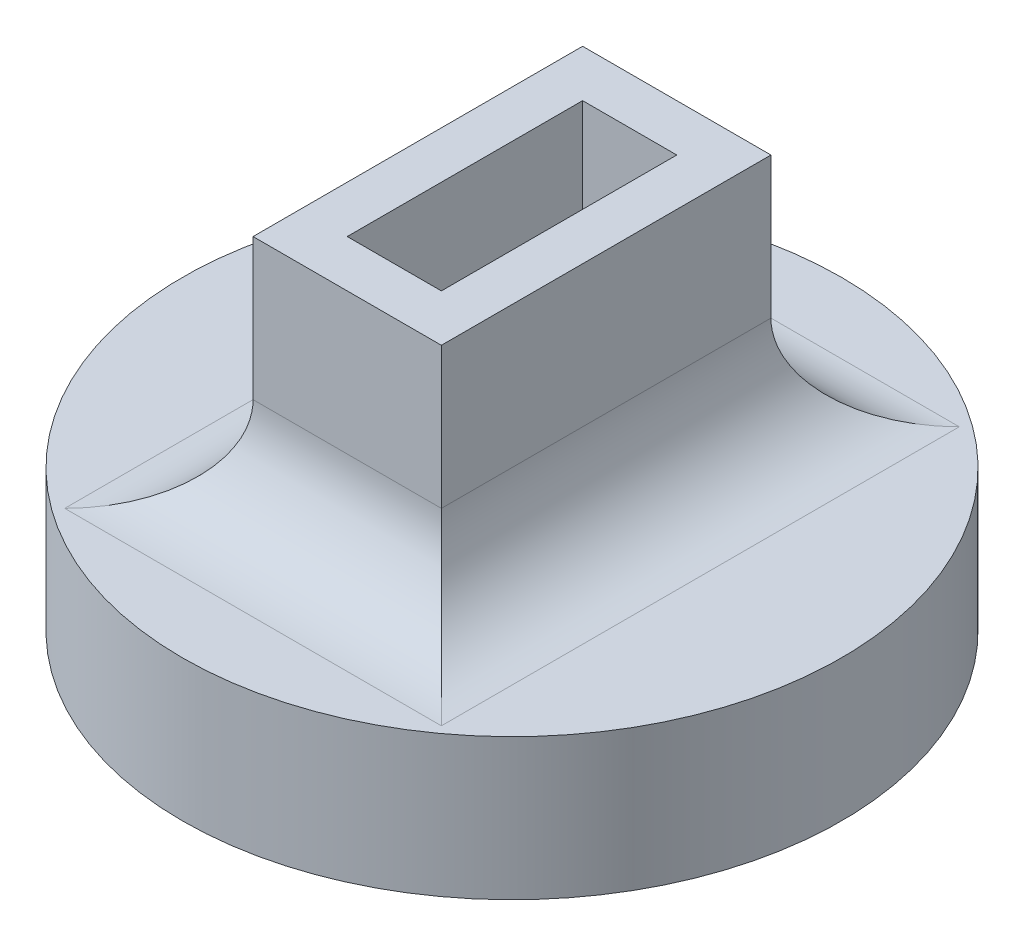
ISO-10303-21;
HEADER;
FILE_DESCRIPTION(('STEP AP214'),'2;1');
FILE_NAME('part.step','',(''),(''),'','','');
FILE_SCHEMA(('AUTOMOTIVE_DESIGN { 1 0 10303 214 1 1 1 1 }'));
ENDSEC;
DATA;
#1=APPLICATION_CONTEXT('core data for automotive mechanical design processes');
#2=APPLICATION_PROTOCOL_DEFINITION('international standard','automotive_design',2000,#1);
#3=PRODUCT_CONTEXT('',#1,'mechanical');
#4=PRODUCT('Part','Part','',(#3));
#5=PRODUCT_RELATED_PRODUCT_CATEGORY('part','',(#4));
#6=PRODUCT_DEFINITION_FORMATION('','',#4);
#7=PRODUCT_DEFINITION_CONTEXT('part definition',#1,'design');
#8=PRODUCT_DEFINITION('design','',#6,#7);
#9=PRODUCT_DEFINITION_SHAPE('','',#8);
#10=(LENGTH_UNIT() NAMED_UNIT(*) SI_UNIT(.MILLI.,.METRE.));
#11=(NAMED_UNIT(*) PLANE_ANGLE_UNIT() SI_UNIT($,.RADIAN.));
#12=(NAMED_UNIT(*) SI_UNIT($,.STERADIAN.) SOLID_ANGLE_UNIT());
#13=UNCERTAINTY_MEASURE_WITH_UNIT(LENGTH_MEASURE(1.E-05),#10,'distance_accuracy_value','');
#14=(GEOMETRIC_REPRESENTATION_CONTEXT(3) GLOBAL_UNCERTAINTY_ASSIGNED_CONTEXT((#13)) GLOBAL_UNIT_ASSIGNED_CONTEXT((#10,
#11,#12)) REPRESENTATION_CONTEXT('',''));
#15=CARTESIAN_POINT('',(0.,0.,0.));
#16=DIRECTION('',(0.,0.,1.));
#17=DIRECTION('',(1.,0.,0.));
#18=AXIS2_PLACEMENT_3D('',#15,#16,#17);
#19=CARTESIAN_POINT('',(0.,3.,0.));
#20=DIRECTION('',(0.,1.,0.));
#21=DIRECTION('',(0.,0.,1.));
#22=AXIS2_PLACEMENT_3D('',#19,#20,#21);
#23=PLANE('',#22);
#24=DIRECTION('',(0.,0.,1.));
#25=VECTOR('',#24,1.);
#26=CARTESIAN_POINT('',(-4.,3.,0.));
#27=LINE('',#26,#25);
#28=CARTESIAN_POINT('',(-4.,3.,5.5));
#29=VERTEX_POINT('',#28);
#30=CARTESIAN_POINT('',(-4.,3.,-5.5));
#31=VERTEX_POINT('',#30);
#32=EDGE_CURVE('E230',#29,#31,#27,.F.);
#33=ORIENTED_EDGE('',*,*,#32,.T.);
#34=DIRECTION('',(1.,0.,0.));
#35=VECTOR('',#34,1.);
#36=CARTESIAN_POINT('',(2.,3.,-5.5));
#37=LINE('',#36,#35);
#38=CARTESIAN_POINT('',(4.,3.,-5.5));
#39=VERTEX_POINT('',#38);
#40=EDGE_CURVE('E242',#31,#39,#37,.T.);
#41=ORIENTED_EDGE('',*,*,#40,.T.);
#42=DIRECTION('',(0.,0.,1.));
#43=VECTOR('',#42,1.);
#44=CARTESIAN_POINT('',(4.,3.,3.5));
#45=LINE('',#44,#43);
#46=CARTESIAN_POINT('',(4.,3.,5.5));
#47=VERTEX_POINT('',#46);
#48=EDGE_CURVE('E239',#39,#47,#45,.T.);
#49=ORIENTED_EDGE('',*,*,#48,.T.);
#50=DIRECTION('',(1.,0.,0.));
#51=VECTOR('',#50,1.);
#52=CARTESIAN_POINT('',(0.,3.,5.5));
#53=LINE('',#52,#51);
#54=EDGE_CURVE('E236',#47,#29,#53,.F.);
#55=ORIENTED_EDGE('',*,*,#54,.T.);
#56=EDGE_LOOP('',(#33,#41,#49,#55));
#57=FACE_BOUND('',#56,.T.);
#58=CARTESIAN_POINT('',(0.,3.,0.));
#59=DIRECTION('',(0.,1.,0.));
#60=DIRECTION('',(0.,0.,1.));
#61=AXIS2_PLACEMENT_3D('',#58,#59,#60);
#62=CIRCLE('',#61,7.);
#63=CARTESIAN_POINT('',(0.,3.,7.));
#64=VERTEX_POINT('',#63);
#65=EDGE_CURVE('E226',#64,#64,#62,.T.);
#66=ORIENTED_EDGE('',*,*,#65,.T.);
#67=EDGE_LOOP('',(#66));
#68=FACE_BOUND('',#67,.T.);
#69=ADVANCED_FACE('F63',(#57,#68),#23,.T.);
#70=CARTESIAN_POINT('',(0.,3.,0.));
#71=DIRECTION('',(0.,-1.,0.));
#72=DIRECTION('',(0.,0.,-1.));
#73=AXIS2_PLACEMENT_3D('',#70,#71,#72);
#74=CYLINDRICAL_SURFACE('',#73,7.);
#75=ORIENTED_EDGE('',*,*,#65,.F.);
#76=EDGE_LOOP('',(#75));
#77=FACE_BOUND('',#76,.T.);
#78=CARTESIAN_POINT('',(0.,0.,0.));
#79=DIRECTION('',(0.,1.,0.));
#80=DIRECTION('',(0.,0.,1.));
#81=AXIS2_PLACEMENT_3D('',#78,#79,#80);
#82=CIRCLE('',#81,7.);
#83=CARTESIAN_POINT('',(0.,0.,7.));
#84=VERTEX_POINT('',#83);
#85=EDGE_CURVE('E225',#84,#84,#82,.T.);
#86=ORIENTED_EDGE('',*,*,#85,.T.);
#87=EDGE_LOOP('',(#86));
#88=FACE_BOUND('',#87,.T.);
#89=ADVANCED_FACE('F291',(#77,#88),#74,.T.);
#90=CARTESIAN_POINT('',(0.,0.,0.));
#91=DIRECTION('',(0.,1.,0.));
#92=DIRECTION('',(0.,0.,1.));
#93=AXIS2_PLACEMENT_3D('',#90,#91,#92);
#94=PLANE('',#93);
#95=ORIENTED_EDGE('',*,*,#85,.F.);
#96=EDGE_LOOP('',(#95));
#97=FACE_BOUND('',#96,.T.);
#98=ADVANCED_FACE('F298',(#97),#94,.F.);
#99=CARTESIAN_POINT('',(-2.,8.,3.5));
#100=DIRECTION('',(0.,0.,-1.));
#101=DIRECTION('',(-1.,0.,0.));
#102=AXIS2_PLACEMENT_3D('',#99,#100,#101);
#103=PLANE('',#102);
#104=DIRECTION('',(0.,-1.,0.));
#105=VECTOR('',#104,1.);
#106=CARTESIAN_POINT('',(-2.,8.,3.5));
#107=LINE('',#106,#105);
#108=CARTESIAN_POINT('',(-2.,8.,3.5));
#109=VERTEX_POINT('',#108);
#110=CARTESIAN_POINT('',(-2.,5.,3.5));
#111=VERTEX_POINT('',#110);
#112=EDGE_CURVE('E212',#109,#111,#107,.T.);
#113=ORIENTED_EDGE('',*,*,#112,.T.);
#114=DIRECTION('',(1.,0.,0.));
#115=VECTOR('',#114,1.);
#116=CARTESIAN_POINT('',(-2.,5.,3.5));
#117=LINE('',#116,#115);
#118=CARTESIAN_POINT('',(2.,5.,3.5));
#119=VERTEX_POINT('',#118);
#120=EDGE_CURVE('E73',#111,#119,#117,.T.);
#121=ORIENTED_EDGE('',*,*,#120,.T.);
#122=DIRECTION('',(0.,-1.,0.));
#123=VECTOR('',#122,1.);
#124=CARTESIAN_POINT('',(2.,8.,3.5));
#125=LINE('',#124,#123);
#126=CARTESIAN_POINT('',(2.,8.,3.5));
#127=VERTEX_POINT('',#126);
#128=EDGE_CURVE('E222',#127,#119,#125,.T.);
#129=ORIENTED_EDGE('',*,*,#128,.F.);
#130=DIRECTION('',(1.,0.,0.));
#131=VECTOR('',#130,1.);
#132=CARTESIAN_POINT('',(-2.,8.,3.5));
#133=LINE('',#132,#131);
#134=EDGE_CURVE('E155',#109,#127,#133,.T.);
#135=ORIENTED_EDGE('',*,*,#134,.F.);
#136=EDGE_LOOP('',(#113,#121,#129,#135));
#137=FACE_BOUND('',#136,.T.);
#138=ADVANCED_FACE('F303',(#137),#103,.F.);
#139=CARTESIAN_POINT('',(2.,8.,-3.5));
#140=DIRECTION('',(1.,0.,0.));
#141=DIRECTION('',(0.,0.,-1.));
#142=AXIS2_PLACEMENT_3D('',#139,#140,#141);
#143=PLANE('',#142);
#144=ORIENTED_EDGE('',*,*,#128,.T.);
#145=DIRECTION('',(0.,0.,1.));
#146=VECTOR('',#145,1.);
#147=CARTESIAN_POINT('',(2.,5.,-3.5));
#148=LINE('',#147,#146);
#149=CARTESIAN_POINT('',(2.,5.,-3.5));
#150=VERTEX_POINT('',#149);
#151=EDGE_CURVE('E250',#119,#150,#148,.F.);
#152=ORIENTED_EDGE('',*,*,#151,.T.);
#153=DIRECTION('',(0.,-1.,0.));
#154=VECTOR('',#153,1.);
#155=CARTESIAN_POINT('',(2.,8.,-3.5));
#156=LINE('',#155,#154);
#157=CARTESIAN_POINT('',(2.,8.,-3.5));
#158=VERTEX_POINT('',#157);
#159=EDGE_CURVE('E218',#158,#150,#156,.T.);
#160=ORIENTED_EDGE('',*,*,#159,.F.);
#161=DIRECTION('',(0.,0.,1.));
#162=VECTOR('',#161,1.);
#163=CARTESIAN_POINT('',(2.,8.,-3.5));
#164=LINE('',#163,#162);
#165=EDGE_CURVE('E201',#158,#127,#164,.T.);
#166=ORIENTED_EDGE('',*,*,#165,.T.);
#167=EDGE_LOOP('',(#144,#152,#160,#166));
#168=FACE_BOUND('',#167,.T.);
#169=ADVANCED_FACE('F279',(#168),#143,.T.);
#170=CARTESIAN_POINT('',(-2.,8.,-3.5));
#171=DIRECTION('',(0.,0.,-1.));
#172=DIRECTION('',(-1.,0.,0.));
#173=AXIS2_PLACEMENT_3D('',#170,#171,#172);
#174=PLANE('',#173);
#175=ORIENTED_EDGE('',*,*,#159,.T.);
#176=DIRECTION('',(1.,0.,0.));
#177=VECTOR('',#176,1.);
#178=CARTESIAN_POINT('',(-2.,5.,-3.5));
#179=LINE('',#178,#177);
#180=CARTESIAN_POINT('',(-2.,5.,-3.5));
#181=VERTEX_POINT('',#180);
#182=EDGE_CURVE('E246',#150,#181,#179,.F.);
#183=ORIENTED_EDGE('',*,*,#182,.T.);
#184=DIRECTION('',(0.,-1.,0.));
#185=VECTOR('',#184,1.);
#186=CARTESIAN_POINT('',(-2.,8.,-3.5));
#187=LINE('',#186,#185);
#188=CARTESIAN_POINT('',(-2.,8.,-3.5));
#189=VERTEX_POINT('',#188);
#190=EDGE_CURVE('E215',#189,#181,#187,.T.);
#191=ORIENTED_EDGE('',*,*,#190,.F.);
#192=DIRECTION('',(1.,0.,0.));
#193=VECTOR('',#192,1.);
#194=CARTESIAN_POINT('',(-2.,8.,-3.5));
#195=LINE('',#194,#193);
#196=EDGE_CURVE('E205',#189,#158,#195,.T.);
#197=ORIENTED_EDGE('',*,*,#196,.T.);
#198=EDGE_LOOP('',(#175,#183,#191,#197));
#199=FACE_BOUND('',#198,.T.);
#200=ADVANCED_FACE('F283',(#199),#174,.T.);
#201=CARTESIAN_POINT('',(-2.,8.,-3.5));
#202=DIRECTION('',(1.,0.,0.));
#203=DIRECTION('',(0.,0.,-1.));
#204=AXIS2_PLACEMENT_3D('',#201,#202,#203);
#205=PLANE('',#204);
#206=ORIENTED_EDGE('',*,*,#190,.T.);
#207=DIRECTION('',(0.,0.,1.));
#208=VECTOR('',#207,1.);
#209=CARTESIAN_POINT('',(-2.,5.,-3.5));
#210=LINE('',#209,#208);
#211=EDGE_CURVE('E12',#181,#111,#210,.T.);
#212=ORIENTED_EDGE('',*,*,#211,.T.);
#213=ORIENTED_EDGE('',*,*,#112,.F.);
#214=DIRECTION('',(0.,0.,1.));
#215=VECTOR('',#214,1.);
#216=CARTESIAN_POINT('',(-2.,8.,-3.5));
#217=LINE('',#216,#215);
#218=EDGE_CURVE('E209',#189,#109,#217,.T.);
#219=ORIENTED_EDGE('',*,*,#218,.F.);
#220=EDGE_LOOP('',(#206,#212,#213,#219));
#221=FACE_BOUND('',#220,.T.);
#222=ADVANCED_FACE('F342',(#221),#205,.F.);
#223=CARTESIAN_POINT('',(0.,8.,0.));
#224=DIRECTION('',(0.,-1.,0.));
#225=DIRECTION('',(0.,0.,-1.));
#226=AXIS2_PLACEMENT_3D('',#223,#224,#225);
#227=PLANE('',#226);
#228=DIRECTION('',(1.,0.,0.));
#229=VECTOR('',#228,1.);
#230=CARTESIAN_POINT('',(0.,8.,-2.5));
#231=LINE('',#230,#229);
#232=CARTESIAN_POINT('',(-1.,8.,-2.5));
#233=VERTEX_POINT('',#232);
#234=CARTESIAN_POINT('',(1.,8.,-2.5));
#235=VERTEX_POINT('',#234);
#236=EDGE_CURVE('E149',#233,#235,#231,.T.);
#237=ORIENTED_EDGE('',*,*,#236,.T.);
#238=DIRECTION('',(0.,0.,1.));
#239=VECTOR('',#238,1.);
#240=CARTESIAN_POINT('',(1.,8.,0.));
#241=LINE('',#240,#239);
#242=CARTESIAN_POINT('',(1.,8.,2.5));
#243=VERTEX_POINT('',#242);
#244=EDGE_CURVE('E160',#235,#243,#241,.T.);
#245=ORIENTED_EDGE('',*,*,#244,.T.);
#246=DIRECTION('',(1.,0.,0.));
#247=VECTOR('',#246,1.);
#248=CARTESIAN_POINT('',(0.,8.,2.5));
#249=LINE('',#248,#247);
#250=CARTESIAN_POINT('',(-0.999999999999999,8.,2.5));
#251=VERTEX_POINT('',#250);
#252=EDGE_CURVE('E176',#251,#243,#249,.T.);
#253=ORIENTED_EDGE('',*,*,#252,.F.);
#254=DIRECTION('',(0.,0.,1.));
#255=VECTOR('',#254,1.);
#256=CARTESIAN_POINT('',(-1.,8.,0.));
#257=LINE('',#256,#255);
#258=EDGE_CURVE('E172',#233,#251,#257,.T.);
#259=ORIENTED_EDGE('',*,*,#258,.F.);
#260=EDGE_LOOP('',(#237,#245,#253,#259));
#261=FACE_BOUND('',#260,.T.);
#262=ORIENTED_EDGE('',*,*,#134,.T.);
#263=ORIENTED_EDGE('',*,*,#165,.F.);
#264=ORIENTED_EDGE('',*,*,#196,.F.);
#265=ORIENTED_EDGE('',*,*,#218,.T.);
#266=EDGE_LOOP('',(#262,#263,#264,#265));
#267=FACE_BOUND('',#266,.T.);
#268=ADVANCED_FACE('F169',(#261,#267),#227,.F.);
#269=CARTESIAN_POINT('',(1.,8.,0.));
#270=DIRECTION('',(1.,0.,0.));
#271=DIRECTION('',(0.,0.,-1.));
#272=AXIS2_PLACEMENT_3D('',#269,#270,#271);
#273=PLANE('',#272);
#274=DIRECTION('',(0.,0.,1.));
#275=VECTOR('',#274,1.);
#276=CARTESIAN_POINT('',(1.,3.,0.));
#277=LINE('',#276,#275);
#278=CARTESIAN_POINT('',(1.,3.,-2.5));
#279=VERTEX_POINT('',#278);
#280=CARTESIAN_POINT('',(1.,3.,2.5));
#281=VERTEX_POINT('',#280);
#282=EDGE_CURVE('E181',#279,#281,#277,.T.);
#283=ORIENTED_EDGE('',*,*,#282,.T.);
#284=DIRECTION('',(0.,-1.,0.));
#285=VECTOR('',#284,1.);
#286=CARTESIAN_POINT('',(1.,8.,2.5));
#287=LINE('',#286,#285);
#288=EDGE_CURVE('E163',#243,#281,#287,.T.);
#289=ORIENTED_EDGE('',*,*,#288,.F.);
#290=ORIENTED_EDGE('',*,*,#244,.F.);
#291=DIRECTION('',(0.,-1.,0.));
#292=VECTOR('',#291,1.);
#293=CARTESIAN_POINT('',(1.,8.,-2.5));
#294=LINE('',#293,#292);
#295=EDGE_CURVE('E144',#235,#279,#294,.T.);
#296=ORIENTED_EDGE('',*,*,#295,.T.);
#297=EDGE_LOOP('',(#283,#289,#290,#296));
#298=FACE_BOUND('',#297,.T.);
#299=ADVANCED_FACE('F161',(#298),#273,.F.);
#300=CARTESIAN_POINT('',(0.,8.,-2.5));
#301=DIRECTION('',(0.,0.,-1.));
#302=DIRECTION('',(-1.,0.,0.));
#303=AXIS2_PLACEMENT_3D('',#300,#301,#302);
#304=PLANE('',#303);
#305=DIRECTION('',(1.,0.,0.));
#306=VECTOR('',#305,1.);
#307=CARTESIAN_POINT('',(0.,3.,-2.5));
#308=LINE('',#307,#306);
#309=CARTESIAN_POINT('',(-1.,3.,-2.5));
#310=VERTEX_POINT('',#309);
#311=EDGE_CURVE('E151',#310,#279,#308,.T.);
#312=ORIENTED_EDGE('',*,*,#311,.T.);
#313=ORIENTED_EDGE('',*,*,#295,.F.);
#314=ORIENTED_EDGE('',*,*,#236,.F.);
#315=DIRECTION('',(0.,-1.,0.));
#316=VECTOR('',#315,1.);
#317=CARTESIAN_POINT('',(-1.,8.,-2.5));
#318=LINE('',#317,#316);
#319=EDGE_CURVE('E156',#233,#310,#318,.T.);
#320=ORIENTED_EDGE('',*,*,#319,.T.);
#321=EDGE_LOOP('',(#312,#313,#314,#320));
#322=FACE_BOUND('',#321,.T.);
#323=ADVANCED_FACE('F146',(#322),#304,.F.);
#324=CARTESIAN_POINT('',(-1.,8.,0.));
#325=DIRECTION('',(1.,0.,0.));
#326=DIRECTION('',(0.,0.,-1.));
#327=AXIS2_PLACEMENT_3D('',#324,#325,#326);
#328=PLANE('',#327);
#329=DIRECTION('',(0.,0.,1.));
#330=VECTOR('',#329,1.);
#331=CARTESIAN_POINT('',(-1.,3.,0.));
#332=LINE('',#331,#330);
#333=CARTESIAN_POINT('',(-0.999999999999999,3.,2.5));
#334=VERTEX_POINT('',#333);
#335=EDGE_CURVE('E186',#310,#334,#332,.T.);
#336=ORIENTED_EDGE('',*,*,#335,.F.);
#337=ORIENTED_EDGE('',*,*,#319,.F.);
#338=ORIENTED_EDGE('',*,*,#258,.T.);
#339=DIRECTION('',(0.,-1.,0.));
#340=VECTOR('',#339,1.);
#341=CARTESIAN_POINT('',(-0.999999999999999,8.,2.5));
#342=LINE('',#341,#340);
#343=EDGE_CURVE('E193',#251,#334,#342,.T.);
#344=ORIENTED_EDGE('',*,*,#343,.T.);
#345=EDGE_LOOP('',(#336,#337,#338,#344));
#346=FACE_BOUND('',#345,.T.);
#347=ADVANCED_FACE('F325',(#346),#328,.T.);
#348=CARTESIAN_POINT('',(0.,8.,2.5));
#349=DIRECTION('',(0.,0.,-1.));
#350=DIRECTION('',(-1.,0.,0.));
#351=AXIS2_PLACEMENT_3D('',#348,#349,#350);
#352=PLANE('',#351);
#353=DIRECTION('',(1.,0.,0.));
#354=VECTOR('',#353,1.);
#355=CARTESIAN_POINT('',(0.,3.,2.5));
#356=LINE('',#355,#354);
#357=EDGE_CURVE('E167',#334,#281,#356,.T.);
#358=ORIENTED_EDGE('',*,*,#357,.F.);
#359=ORIENTED_EDGE('',*,*,#343,.F.);
#360=ORIENTED_EDGE('',*,*,#252,.T.);
#361=ORIENTED_EDGE('',*,*,#288,.T.);
#362=EDGE_LOOP('',(#358,#359,#360,#361));
#363=FACE_BOUND('',#362,.T.);
#364=ADVANCED_FACE('F320',(#363),#352,.T.);
#365=ORIENTED_EDGE('',*,*,#357,.T.);
#366=ORIENTED_EDGE('',*,*,#282,.F.);
#367=ORIENTED_EDGE('',*,*,#311,.F.);
#368=ORIENTED_EDGE('',*,*,#335,.T.);
#369=EDGE_LOOP('',(#365,#366,#367,#368));
#370=FACE_BOUND('',#369,.T.);
#371=ADVANCED_FACE('F293',(#370),#23,.T.);
#372=CARTESIAN_POINT('',(-2.,5.,5.5));
#373=DIRECTION('',(1.,0.,0.));
#374=DIRECTION('',(0.,0.,-1.));
#375=AXIS2_PLACEMENT_3D('',#372,#373,#374);
#376=CYLINDRICAL_SURFACE('',#375,2.);
#377=CARTESIAN_POINT('',(4.,5.,5.5));
#378=DIRECTION('',(0.707106781186547,0.,-0.707106781186548));
#379=DIRECTION('',(0.707106781186548,0.,0.707106781186547));
#380=AXIS2_PLACEMENT_3D('',#377,#378,#379);
#381=ELLIPSE('',#380,2.82842712474619,2.);
#382=EDGE_CURVE('E260',#119,#47,#381,.F.);
#383=ORIENTED_EDGE('',*,*,#382,.F.);
#384=ORIENTED_EDGE('',*,*,#120,.F.);
#385=CARTESIAN_POINT('',(-4.,5.,5.5));
#386=DIRECTION('',(0.707106781186548,0.,0.707106781186547));
#387=DIRECTION('',(-0.707106781186547,0.,0.707106781186548));
#388=AXIS2_PLACEMENT_3D('',#385,#386,#387);
#389=ELLIPSE('',#388,2.82842712474619,2.);
#390=EDGE_CURVE('E67',#29,#111,#389,.T.);
#391=ORIENTED_EDGE('',*,*,#390,.F.);
#392=ORIENTED_EDGE('',*,*,#54,.F.);
#393=EDGE_LOOP('',(#383,#384,#391,#392));
#394=FACE_BOUND('',#393,.T.);
#395=ADVANCED_FACE('F65',(#394),#376,.F.);
#396=CARTESIAN_POINT('',(-4.,5.,-3.5));
#397=DIRECTION('',(0.,0.,1.));
#398=DIRECTION('',(1.,0.,0.));
#399=AXIS2_PLACEMENT_3D('',#396,#397,#398);
#400=CYLINDRICAL_SURFACE('',#399,2.);
#401=ORIENTED_EDGE('',*,*,#390,.T.);
#402=ORIENTED_EDGE('',*,*,#211,.F.);
#403=CARTESIAN_POINT('',(-4.,5.,-5.5));
#404=DIRECTION('',(-0.707106781186547,0.,0.707106781186548));
#405=DIRECTION('',(0.707106781186548,0.,0.707106781186547));
#406=AXIS2_PLACEMENT_3D('',#403,#404,#405);
#407=ELLIPSE('',#406,2.82842712474619,2.);
#408=EDGE_CURVE('E258',#31,#181,#407,.T.);
#409=ORIENTED_EDGE('',*,*,#408,.F.);
#410=ORIENTED_EDGE('',*,*,#32,.F.);
#411=EDGE_LOOP('',(#401,#402,#409,#410));
#412=FACE_BOUND('',#411,.T.);
#413=ADVANCED_FACE('F272',(#412),#400,.F.);
#414=CARTESIAN_POINT('',(4.,5.,0.));
#415=DIRECTION('',(0.,0.,-1.));
#416=DIRECTION('',(-1.,0.,0.));
#417=AXIS2_PLACEMENT_3D('',#414,#415,#416);
#418=CYLINDRICAL_SURFACE('',#417,2.);
#419=ORIENTED_EDGE('',*,*,#382,.T.);
#420=ORIENTED_EDGE('',*,*,#48,.F.);
#421=CARTESIAN_POINT('',(4.,5.,-5.5));
#422=DIRECTION('',(-0.707106781186548,0.,-0.707106781186547));
#423=DIRECTION('',(0.707106781186547,0.,-0.707106781186548));
#424=AXIS2_PLACEMENT_3D('',#421,#422,#423);
#425=ELLIPSE('',#424,2.82842712474619,2.);
#426=EDGE_CURVE('E255',#150,#39,#425,.F.);
#427=ORIENTED_EDGE('',*,*,#426,.F.);
#428=ORIENTED_EDGE('',*,*,#151,.F.);
#429=EDGE_LOOP('',(#419,#420,#427,#428));
#430=FACE_BOUND('',#429,.T.);
#431=ADVANCED_FACE('F277',(#430),#418,.F.);
#432=CARTESIAN_POINT('',(0.,5.,-5.5));
#433=DIRECTION('',(-1.,0.,0.));
#434=DIRECTION('',(0.,0.,1.));
#435=AXIS2_PLACEMENT_3D('',#432,#433,#434);
#436=CYLINDRICAL_SURFACE('',#435,2.);
#437=ORIENTED_EDGE('',*,*,#408,.T.);
#438=ORIENTED_EDGE('',*,*,#182,.F.);
#439=ORIENTED_EDGE('',*,*,#426,.T.);
#440=ORIENTED_EDGE('',*,*,#40,.F.);
#441=EDGE_LOOP('',(#437,#438,#439,#440));
#442=FACE_BOUND('',#441,.T.);
#443=ADVANCED_FACE('F286',(#442),#436,.F.);
#444=CLOSED_SHELL('',(#69,#89,#98,#138,#169,#200,#222,#268,#299,#323,#347,#364,#371,#395,#413,
#431,#443));
#445=MANIFOLD_SOLID_BREP('B2',#444);
#446=ADVANCED_BREP_SHAPE_REPRESENTATION('',(#18,#445),#14);
#447=SHAPE_DEFINITION_REPRESENTATION(#9,#446);
ENDSEC;
END-ISO-10303-21;
